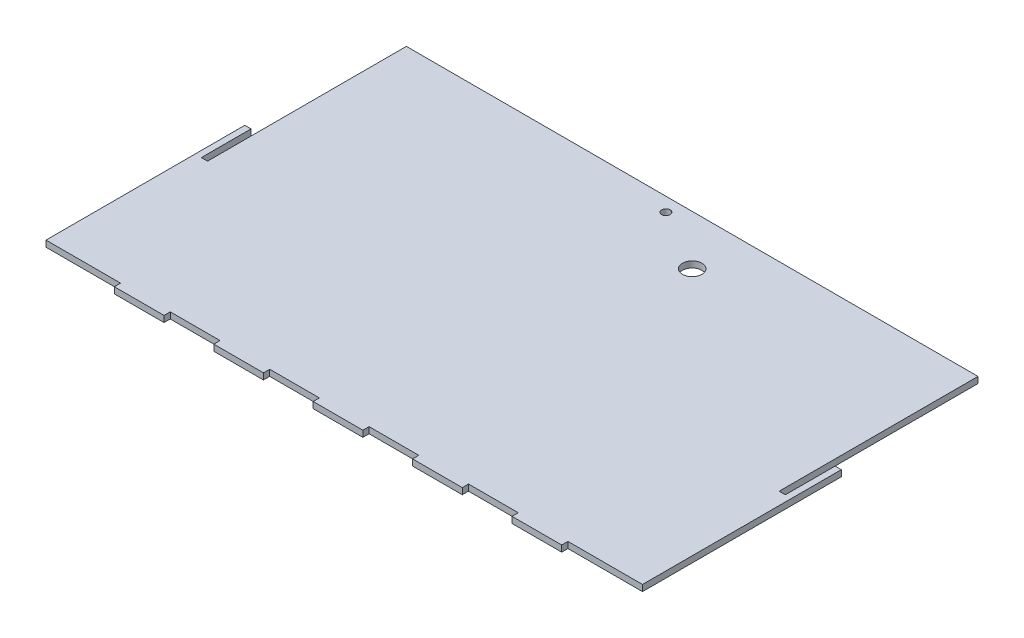
ISO-10303-21;
HEADER;
FILE_DESCRIPTION(('STEP AP214'),'2;1');
FILE_NAME('part.step','',(''),(''),'','','');
FILE_SCHEMA(('AUTOMOTIVE_DESIGN { 1 0 10303 214 1 1 1 1 }'));
ENDSEC;
DATA;
#1=APPLICATION_CONTEXT('core data for automotive mechanical design processes');
#2=APPLICATION_PROTOCOL_DEFINITION('international standard','automotive_design',2000,#1);
#3=PRODUCT_CONTEXT('',#1,'mechanical');
#4=PRODUCT('Part','Part','',(#3));
#5=PRODUCT_RELATED_PRODUCT_CATEGORY('part','',(#4));
#6=PRODUCT_DEFINITION_FORMATION('','',#4);
#7=PRODUCT_DEFINITION_CONTEXT('part definition',#1,'design');
#8=PRODUCT_DEFINITION('design','',#6,#7);
#9=PRODUCT_DEFINITION_SHAPE('','',#8);
#10=(LENGTH_UNIT() NAMED_UNIT(*) SI_UNIT(.MILLI.,.METRE.));
#11=(NAMED_UNIT(*) PLANE_ANGLE_UNIT() SI_UNIT($,.RADIAN.));
#12=(NAMED_UNIT(*) SI_UNIT($,.STERADIAN.) SOLID_ANGLE_UNIT());
#13=UNCERTAINTY_MEASURE_WITH_UNIT(LENGTH_MEASURE(1.E-05),#10,'distance_accuracy_value','');
#14=(GEOMETRIC_REPRESENTATION_CONTEXT(3) GLOBAL_UNCERTAINTY_ASSIGNED_CONTEXT((#13)) GLOBAL_UNIT_ASSIGNED_CONTEXT((#10,
#11,#12)) REPRESENTATION_CONTEXT('',''));
#15=CARTESIAN_POINT('',(0.,0.,0.));
#16=DIRECTION('',(0.,0.,1.));
#17=DIRECTION('',(1.,0.,0.));
#18=AXIS2_PLACEMENT_3D('',#15,#16,#17);
#19=CARTESIAN_POINT('',(-1.52655665885937E-13,1.5875,-12.6999999999982));
#20=DIRECTION('',(0.,0.,-1.));
#21=DIRECTION('',(-1.,0.,0.));
#22=AXIS2_PLACEMENT_3D('',#19,#20,#21);
#23=PLANE('',#22);
#24=DIRECTION('',(1.,0.,0.));
#25=VECTOR('',#24,1.);
#26=CARTESIAN_POINT('',(-1.52655665885937E-13,-1.5875,-12.6999999999982));
#27=LINE('',#26,#25);
#28=CARTESIAN_POINT('',(149.225,-1.5875,-12.7));
#29=VERTEX_POINT('',#28);
#30=CARTESIAN_POINT('',(152.4,-1.5875,-12.7));
#31=VERTEX_POINT('',#30);
#32=EDGE_CURVE('E290',#29,#31,#27,.T.);
#33=ORIENTED_EDGE('',*,*,#32,.F.);
#34=DIRECTION('',(0.,-1.,0.));
#35=VECTOR('',#34,1.);
#36=CARTESIAN_POINT('',(149.225,1.5875,-12.7));
#37=LINE('',#36,#35);
#38=CARTESIAN_POINT('',(149.225,1.5875,-12.7));
#39=VERTEX_POINT('',#38);
#40=EDGE_CURVE('E11',#39,#29,#37,.T.);
#41=ORIENTED_EDGE('',*,*,#40,.F.);
#42=DIRECTION('',(1.,0.,0.));
#43=VECTOR('',#42,1.);
#44=CARTESIAN_POINT('',(-1.52655665885937E-13,1.5875,-12.6999999999982));
#45=LINE('',#44,#43);
#46=CARTESIAN_POINT('',(152.4,1.5875,-12.7));
#47=VERTEX_POINT('',#46);
#48=EDGE_CURVE('E465',#39,#47,#45,.T.);
#49=ORIENTED_EDGE('',*,*,#48,.T.);
#50=DIRECTION('',(0.,-1.,0.));
#51=VECTOR('',#50,1.);
#52=CARTESIAN_POINT('',(152.4,1.5875,-12.7));
#53=LINE('',#52,#51);
#54=EDGE_CURVE('E165',#47,#31,#53,.T.);
#55=ORIENTED_EDGE('',*,*,#54,.T.);
#56=EDGE_LOOP('',(#33,#41,#49,#55));
#57=FACE_BOUND('',#56,.T.);
#58=ADVANCED_FACE('F41',(#57),#23,.T.);
#59=CARTESIAN_POINT('',(149.225,1.5875,0.));
#60=DIRECTION('',(-1.,0.,0.));
#61=DIRECTION('',(0.,0.,1.));
#62=AXIS2_PLACEMENT_3D('',#59,#60,#61);
#63=PLANE('',#62);
#64=DIRECTION('',(0.,0.,-1.));
#65=VECTOR('',#64,1.);
#66=CARTESIAN_POINT('',(149.225,-1.5875,0.));
#67=LINE('',#66,#65);
#68=CARTESIAN_POINT('',(149.225,-1.5875,12.7));
#69=VERTEX_POINT('',#68);
#70=EDGE_CURVE('E292',#69,#29,#67,.T.);
#71=ORIENTED_EDGE('',*,*,#70,.F.);
#72=DIRECTION('',(0.,-1.,0.));
#73=VECTOR('',#72,1.);
#74=CARTESIAN_POINT('',(149.225,1.5875,12.7));
#75=LINE('',#74,#73);
#76=CARTESIAN_POINT('',(149.225,1.5875,12.7));
#77=VERTEX_POINT('',#76);
#78=EDGE_CURVE('E50',#77,#69,#75,.T.);
#79=ORIENTED_EDGE('',*,*,#78,.F.);
#80=DIRECTION('',(0.,0.,-1.));
#81=VECTOR('',#80,1.);
#82=CARTESIAN_POINT('',(149.225,1.5875,0.));
#83=LINE('',#82,#81);
#84=EDGE_CURVE('E461',#77,#39,#83,.T.);
#85=ORIENTED_EDGE('',*,*,#84,.T.);
#86=ORIENTED_EDGE('',*,*,#40,.T.);
#87=EDGE_LOOP('',(#71,#79,#85,#86));
#88=FACE_BOUND('',#87,.T.);
#89=ADVANCED_FACE('F449',(#88),#63,.T.);
#90=CARTESIAN_POINT('',(0.,1.5875,12.7));
#91=DIRECTION('',(0.,0.,-1.));
#92=DIRECTION('',(-1.,0.,0.));
#93=AXIS2_PLACEMENT_3D('',#90,#91,#92);
#94=PLANE('',#93);
#95=DIRECTION('',(1.,0.,0.));
#96=VECTOR('',#95,1.);
#97=CARTESIAN_POINT('',(0.,-1.5875,12.7));
#98=LINE('',#97,#96);
#99=CARTESIAN_POINT('',(146.05,-1.5875,12.7));
#100=VERTEX_POINT('',#99);
#101=EDGE_CURVE('E295',#100,#69,#98,.T.);
#102=ORIENTED_EDGE('',*,*,#101,.F.);
#103=DIRECTION('',(0.,-1.,0.));
#104=VECTOR('',#103,1.);
#105=CARTESIAN_POINT('',(146.05,1.5875,12.7));
#106=LINE('',#105,#104);
#107=CARTESIAN_POINT('',(146.05,1.5875,12.7));
#108=VERTEX_POINT('',#107);
#109=EDGE_CURVE('E438',#108,#100,#106,.T.);
#110=ORIENTED_EDGE('',*,*,#109,.F.);
#111=DIRECTION('',(1.,0.,0.));
#112=VECTOR('',#111,1.);
#113=CARTESIAN_POINT('',(0.,1.5875,12.7));
#114=LINE('',#113,#112);
#115=EDGE_CURVE('E445',#108,#77,#114,.T.);
#116=ORIENTED_EDGE('',*,*,#115,.T.);
#117=ORIENTED_EDGE('',*,*,#78,.T.);
#118=EDGE_LOOP('',(#102,#110,#116,#117));
#119=FACE_BOUND('',#118,.T.);
#120=ADVANCED_FACE('F443',(#119),#94,.T.);
#121=CARTESIAN_POINT('',(146.05,1.5875,0.));
#122=DIRECTION('',(1.,0.,0.));
#123=DIRECTION('',(0.,0.,-1.));
#124=AXIS2_PLACEMENT_3D('',#121,#122,#123);
#125=PLANE('',#124);
#126=DIRECTION('',(0.,0.,1.));
#127=VECTOR('',#126,1.);
#128=CARTESIAN_POINT('',(146.05,-1.5875,0.));
#129=LINE('',#128,#127);
#130=CARTESIAN_POINT('',(146.05,-1.5875,-88.9));
#131=VERTEX_POINT('',#130);
#132=EDGE_CURVE('E298',#131,#100,#129,.T.);
#133=ORIENTED_EDGE('',*,*,#132,.F.);
#134=DIRECTION('',(0.,-1.,0.));
#135=VECTOR('',#134,1.);
#136=CARTESIAN_POINT('',(146.05,1.5875,-88.9));
#137=LINE('',#136,#135);
#138=CARTESIAN_POINT('',(146.05,1.5875,-88.9));
#139=VERTEX_POINT('',#138);
#140=EDGE_CURVE('E436',#139,#131,#137,.T.);
#141=ORIENTED_EDGE('',*,*,#140,.F.);
#142=DIRECTION('',(0.,0.,1.));
#143=VECTOR('',#142,1.);
#144=CARTESIAN_POINT('',(146.05,1.5875,0.));
#145=LINE('',#144,#143);
#146=EDGE_CURVE('E458',#139,#108,#145,.T.);
#147=ORIENTED_EDGE('',*,*,#146,.T.);
#148=ORIENTED_EDGE('',*,*,#109,.T.);
#149=EDGE_LOOP('',(#133,#141,#147,#148));
#150=FACE_BOUND('',#149,.T.);
#151=ADVANCED_FACE('F455',(#150),#125,.T.);
#152=CARTESIAN_POINT('',(0.,1.5875,-88.9));
#153=DIRECTION('',(0.,0.,-1.));
#154=DIRECTION('',(-1.,0.,0.));
#155=AXIS2_PLACEMENT_3D('',#152,#153,#154);
#156=PLANE('',#155);
#157=DIRECTION('',(1.,0.,0.));
#158=VECTOR('',#157,1.);
#159=CARTESIAN_POINT('',(0.,-1.5875,-88.9));
#160=LINE('',#159,#158);
#161=CARTESIAN_POINT('',(-146.05,-1.5875,-88.9));
#162=VERTEX_POINT('',#161);
#163=EDGE_CURVE('E301',#162,#131,#160,.T.);
#164=ORIENTED_EDGE('',*,*,#163,.F.);
#165=DIRECTION('',(0.,-1.,0.));
#166=VECTOR('',#165,1.);
#167=CARTESIAN_POINT('',(-146.05,1.5875,-88.9));
#168=LINE('',#167,#166);
#169=CARTESIAN_POINT('',(-146.05,1.5875,-88.9));
#170=VERTEX_POINT('',#169);
#171=EDGE_CURVE('E434',#170,#162,#168,.T.);
#172=ORIENTED_EDGE('',*,*,#171,.F.);
#173=DIRECTION('',(1.,0.,0.));
#174=VECTOR('',#173,1.);
#175=CARTESIAN_POINT('',(0.,1.5875,-88.9));
#176=LINE('',#175,#174);
#177=EDGE_CURVE('E463',#170,#139,#176,.T.);
#178=ORIENTED_EDGE('',*,*,#177,.T.);
#179=ORIENTED_EDGE('',*,*,#140,.T.);
#180=EDGE_LOOP('',(#164,#172,#178,#179));
#181=FACE_BOUND('',#180,.T.);
#182=ADVANCED_FACE('F613',(#181),#156,.T.);
#183=CARTESIAN_POINT('',(-146.05,1.5875,0.));
#184=DIRECTION('',(1.,0.,0.));
#185=DIRECTION('',(0.,0.,-1.));
#186=AXIS2_PLACEMENT_3D('',#183,#184,#185);
#187=PLANE('',#186);
#188=DIRECTION('',(0.,0.,1.));
#189=VECTOR('',#188,1.);
#190=CARTESIAN_POINT('',(-146.05,-1.5875,0.));
#191=LINE('',#190,#189);
#192=CARTESIAN_POINT('',(-146.05,-1.5875,12.7));
#193=VERTEX_POINT('',#192);
#194=EDGE_CURVE('E304',#162,#193,#191,.T.);
#195=ORIENTED_EDGE('',*,*,#194,.T.);
#196=DIRECTION('',(0.,-1.,0.));
#197=VECTOR('',#196,1.);
#198=CARTESIAN_POINT('',(-146.05,1.5875,12.7));
#199=LINE('',#198,#197);
#200=CARTESIAN_POINT('',(-146.05,1.5875,12.7));
#201=VERTEX_POINT('',#200);
#202=EDGE_CURVE('E431',#201,#193,#199,.T.);
#203=ORIENTED_EDGE('',*,*,#202,.F.);
#204=DIRECTION('',(0.,0.,1.));
#205=VECTOR('',#204,1.);
#206=CARTESIAN_POINT('',(-146.05,1.5875,0.));
#207=LINE('',#206,#205);
#208=EDGE_CURVE('E470',#170,#201,#207,.T.);
#209=ORIENTED_EDGE('',*,*,#208,.F.);
#210=ORIENTED_EDGE('',*,*,#171,.T.);
#211=EDGE_LOOP('',(#195,#203,#209,#210));
#212=FACE_BOUND('',#211,.T.);
#213=ADVANCED_FACE('F615',(#212),#187,.F.);
#214=CARTESIAN_POINT('',(0.,1.5875,12.7));
#215=DIRECTION('',(0.,0.,1.));
#216=DIRECTION('',(1.,0.,0.));
#217=AXIS2_PLACEMENT_3D('',#214,#215,#216);
#218=PLANE('',#217);
#219=DIRECTION('',(-1.,0.,0.));
#220=VECTOR('',#219,1.);
#221=CARTESIAN_POINT('',(0.,-1.5875,12.7));
#222=LINE('',#221,#220);
#223=CARTESIAN_POINT('',(-149.225,-1.5875,12.7));
#224=VERTEX_POINT('',#223);
#225=EDGE_CURVE('E307',#193,#224,#222,.T.);
#226=ORIENTED_EDGE('',*,*,#225,.T.);
#227=DIRECTION('',(0.,-1.,0.));
#228=VECTOR('',#227,1.);
#229=CARTESIAN_POINT('',(-149.225,1.5875,12.7));
#230=LINE('',#229,#228);
#231=CARTESIAN_POINT('',(-149.225,1.5875,12.7));
#232=VERTEX_POINT('',#231);
#233=EDGE_CURVE('E428',#232,#224,#230,.T.);
#234=ORIENTED_EDGE('',*,*,#233,.F.);
#235=DIRECTION('',(-1.,0.,0.));
#236=VECTOR('',#235,1.);
#237=CARTESIAN_POINT('',(0.,1.5875,12.7));
#238=LINE('',#237,#236);
#239=EDGE_CURVE('E473',#201,#232,#238,.T.);
#240=ORIENTED_EDGE('',*,*,#239,.F.);
#241=ORIENTED_EDGE('',*,*,#202,.T.);
#242=EDGE_LOOP('',(#226,#234,#240,#241));
#243=FACE_BOUND('',#242,.T.);
#244=ADVANCED_FACE('F609',(#243),#218,.F.);
#245=CARTESIAN_POINT('',(-149.225,1.5875,0.));
#246=DIRECTION('',(-1.,0.,0.));
#247=DIRECTION('',(0.,0.,1.));
#248=AXIS2_PLACEMENT_3D('',#245,#246,#247);
#249=PLANE('',#248);
#250=DIRECTION('',(0.,0.,-1.));
#251=VECTOR('',#250,1.);
#252=CARTESIAN_POINT('',(-149.225,-1.5875,0.));
#253=LINE('',#252,#251);
#254=CARTESIAN_POINT('',(-149.225,-1.5875,-12.7));
#255=VERTEX_POINT('',#254);
#256=EDGE_CURVE('E310',#224,#255,#253,.T.);
#257=ORIENTED_EDGE('',*,*,#256,.T.);
#258=DIRECTION('',(0.,-1.,0.));
#259=VECTOR('',#258,1.);
#260=CARTESIAN_POINT('',(-149.225,1.5875,-12.7));
#261=LINE('',#260,#259);
#262=CARTESIAN_POINT('',(-149.225,1.5875,-12.7));
#263=VERTEX_POINT('',#262);
#264=EDGE_CURVE('E425',#263,#255,#261,.T.);
#265=ORIENTED_EDGE('',*,*,#264,.F.);
#266=DIRECTION('',(0.,0.,-1.));
#267=VECTOR('',#266,1.);
#268=CARTESIAN_POINT('',(-149.225,1.5875,0.));
#269=LINE('',#268,#267);
#270=EDGE_CURVE('E476',#232,#263,#269,.T.);
#271=ORIENTED_EDGE('',*,*,#270,.F.);
#272=ORIENTED_EDGE('',*,*,#233,.T.);
#273=EDGE_LOOP('',(#257,#265,#271,#272));
#274=FACE_BOUND('',#273,.T.);
#275=ADVANCED_FACE('F606',(#274),#249,.F.);
#276=CARTESIAN_POINT('',(0.,1.5875,-12.7000000000003));
#277=DIRECTION('',(0.,0.,1.));
#278=DIRECTION('',(1.,0.,0.));
#279=AXIS2_PLACEMENT_3D('',#276,#277,#278);
#280=PLANE('',#279);
#281=DIRECTION('',(-1.,0.,0.));
#282=VECTOR('',#281,1.);
#283=CARTESIAN_POINT('',(0.,-1.5875,-12.7000000000003));
#284=LINE('',#283,#282);
#285=CARTESIAN_POINT('',(-152.4,-1.5875,-12.7));
#286=VERTEX_POINT('',#285);
#287=EDGE_CURVE('E313',#255,#286,#284,.T.);
#288=ORIENTED_EDGE('',*,*,#287,.T.);
#289=DIRECTION('',(0.,-1.,0.));
#290=VECTOR('',#289,1.);
#291=CARTESIAN_POINT('',(-152.4,1.5875,-12.7));
#292=LINE('',#291,#290);
#293=CARTESIAN_POINT('',(-152.4,1.5875,-12.7));
#294=VERTEX_POINT('',#293);
#295=EDGE_CURVE('E423',#294,#286,#292,.T.);
#296=ORIENTED_EDGE('',*,*,#295,.F.);
#297=DIRECTION('',(-1.,0.,0.));
#298=VECTOR('',#297,1.);
#299=CARTESIAN_POINT('',(0.,1.5875,-12.7000000000003));
#300=LINE('',#299,#298);
#301=EDGE_CURVE('E479',#263,#294,#300,.T.);
#302=ORIENTED_EDGE('',*,*,#301,.F.);
#303=ORIENTED_EDGE('',*,*,#264,.T.);
#304=EDGE_LOOP('',(#288,#296,#302,#303));
#305=FACE_BOUND('',#304,.T.);
#306=ADVANCED_FACE('F604',(#305),#280,.F.);
#307=CARTESIAN_POINT('',(-152.4,1.5875,0.));
#308=DIRECTION('',(-1.,0.,0.));
#309=DIRECTION('',(0.,0.,1.));
#310=AXIS2_PLACEMENT_3D('',#307,#308,#309);
#311=PLANE('',#310);
#312=DIRECTION('',(0.,0.,-1.));
#313=VECTOR('',#312,1.);
#314=CARTESIAN_POINT('',(-152.4,-1.5875,0.));
#315=LINE('',#314,#313);
#316=CARTESIAN_POINT('',(-152.4,-1.5875,88.9));
#317=VERTEX_POINT('',#316);
#318=EDGE_CURVE('E316',#317,#286,#315,.T.);
#319=ORIENTED_EDGE('',*,*,#318,.F.);
#320=DIRECTION('',(0.,-1.,0.));
#321=VECTOR('',#320,1.);
#322=CARTESIAN_POINT('',(-152.4,1.5875,88.9));
#323=LINE('',#322,#321);
#324=CARTESIAN_POINT('',(-152.4,1.5875,88.9));
#325=VERTEX_POINT('',#324);
#326=EDGE_CURVE('E421',#325,#317,#323,.T.);
#327=ORIENTED_EDGE('',*,*,#326,.F.);
#328=DIRECTION('',(0.,0.,-1.));
#329=VECTOR('',#328,1.);
#330=CARTESIAN_POINT('',(-152.4,1.5875,0.));
#331=LINE('',#330,#329);
#332=EDGE_CURVE('E481',#325,#294,#331,.T.);
#333=ORIENTED_EDGE('',*,*,#332,.T.);
#334=ORIENTED_EDGE('',*,*,#295,.T.);
#335=EDGE_LOOP('',(#319,#327,#333,#334));
#336=FACE_BOUND('',#335,.T.);
#337=ADVANCED_FACE('F600',(#336),#311,.T.);
#338=CARTESIAN_POINT('',(0.,1.5875,88.9));
#339=DIRECTION('',(0.,0.,-1.));
#340=DIRECTION('',(-1.,0.,0.));
#341=AXIS2_PLACEMENT_3D('',#338,#339,#340);
#342=PLANE('',#341);
#343=DIRECTION('',(1.,0.,0.));
#344=VECTOR('',#343,1.);
#345=CARTESIAN_POINT('',(0.,-1.5875,88.9));
#346=LINE('',#345,#344);
#347=CARTESIAN_POINT('',(-114.3,-1.5875,88.9));
#348=VERTEX_POINT('',#347);
#349=EDGE_CURVE('E319',#317,#348,#346,.T.);
#350=ORIENTED_EDGE('',*,*,#349,.T.);
#351=DIRECTION('',(0.,-1.,0.));
#352=VECTOR('',#351,1.);
#353=CARTESIAN_POINT('',(-114.3,1.5875,88.9));
#354=LINE('',#353,#352);
#355=CARTESIAN_POINT('',(-114.3,1.5875,88.9));
#356=VERTEX_POINT('',#355);
#357=EDGE_CURVE('E418',#356,#348,#354,.T.);
#358=ORIENTED_EDGE('',*,*,#357,.F.);
#359=DIRECTION('',(1.,0.,0.));
#360=VECTOR('',#359,1.);
#361=CARTESIAN_POINT('',(0.,1.5875,88.9));
#362=LINE('',#361,#360);
#363=EDGE_CURVE('E273',#325,#356,#362,.T.);
#364=ORIENTED_EDGE('',*,*,#363,.F.);
#365=ORIENTED_EDGE('',*,*,#326,.T.);
#366=EDGE_LOOP('',(#350,#358,#364,#365));
#367=FACE_BOUND('',#366,.T.);
#368=ADVANCED_FACE('F597',(#367),#342,.F.);
#369=CARTESIAN_POINT('',(-114.3,1.5875,0.));
#370=DIRECTION('',(1.,0.,0.));
#371=DIRECTION('',(0.,0.,-1.));
#372=AXIS2_PLACEMENT_3D('',#369,#370,#371);
#373=PLANE('',#372);
#374=DIRECTION('',(0.,0.,1.));
#375=VECTOR('',#374,1.);
#376=CARTESIAN_POINT('',(-114.3,-1.5875,0.));
#377=LINE('',#376,#375);
#378=CARTESIAN_POINT('',(-114.3,-1.5875,92.075));
#379=VERTEX_POINT('',#378);
#380=EDGE_CURVE('E322',#348,#379,#377,.T.);
#381=ORIENTED_EDGE('',*,*,#380,.T.);
#382=DIRECTION('',(0.,-1.,0.));
#383=VECTOR('',#382,1.);
#384=CARTESIAN_POINT('',(-114.3,1.5875,92.075));
#385=LINE('',#384,#383);
#386=CARTESIAN_POINT('',(-114.3,1.5875,92.075));
#387=VERTEX_POINT('',#386);
#388=EDGE_CURVE('E415',#387,#379,#385,.T.);
#389=ORIENTED_EDGE('',*,*,#388,.F.);
#390=DIRECTION('',(0.,0.,1.));
#391=VECTOR('',#390,1.);
#392=CARTESIAN_POINT('',(-114.3,1.5875,0.));
#393=LINE('',#392,#391);
#394=EDGE_CURVE('E485',#356,#387,#393,.T.);
#395=ORIENTED_EDGE('',*,*,#394,.F.);
#396=ORIENTED_EDGE('',*,*,#357,.T.);
#397=EDGE_LOOP('',(#381,#389,#395,#396));
#398=FACE_BOUND('',#397,.T.);
#399=ADVANCED_FACE('F594',(#398),#373,.F.);
#400=CARTESIAN_POINT('',(0.,1.5875,92.075));
#401=DIRECTION('',(0.,0.,-1.));
#402=DIRECTION('',(-1.,0.,0.));
#403=AXIS2_PLACEMENT_3D('',#400,#401,#402);
#404=PLANE('',#403);
#405=DIRECTION('',(1.,0.,0.));
#406=VECTOR('',#405,1.);
#407=CARTESIAN_POINT('',(0.,-1.5875,92.075));
#408=LINE('',#407,#406);
#409=CARTESIAN_POINT('',(-88.9,-1.5875,92.075));
#410=VERTEX_POINT('',#409);
#411=EDGE_CURVE('E327',#379,#410,#408,.T.);
#412=ORIENTED_EDGE('',*,*,#411,.T.);
#413=DIRECTION('',(0.,-1.,0.));
#414=VECTOR('',#413,1.);
#415=CARTESIAN_POINT('',(-88.9,1.5875,92.075));
#416=LINE('',#415,#414);
#417=CARTESIAN_POINT('',(-88.9,1.5875,92.075));
#418=VERTEX_POINT('',#417);
#419=EDGE_CURVE('E413',#418,#410,#416,.T.);
#420=ORIENTED_EDGE('',*,*,#419,.F.);
#421=DIRECTION('',(1.,0.,0.));
#422=VECTOR('',#421,1.);
#423=CARTESIAN_POINT('',(0.,1.5875,92.075));
#424=LINE('',#423,#422);
#425=EDGE_CURVE('E489',#387,#418,#424,.T.);
#426=ORIENTED_EDGE('',*,*,#425,.F.);
#427=ORIENTED_EDGE('',*,*,#388,.T.);
#428=EDGE_LOOP('',(#412,#420,#426,#427));
#429=FACE_BOUND('',#428,.T.);
#430=ADVANCED_FACE('F588',(#429),#404,.F.);
#431=CARTESIAN_POINT('',(-88.9,1.5875,0.));
#432=DIRECTION('',(1.,0.,0.));
#433=DIRECTION('',(0.,0.,-1.));
#434=AXIS2_PLACEMENT_3D('',#431,#432,#433);
#435=PLANE('',#434);
#436=DIRECTION('',(0.,0.,1.));
#437=VECTOR('',#436,1.);
#438=CARTESIAN_POINT('',(-88.9,-1.5875,0.));
#439=LINE('',#438,#437);
#440=CARTESIAN_POINT('',(-88.9,-1.5875,88.9));
#441=VERTEX_POINT('',#440);
#442=EDGE_CURVE('E330',#441,#410,#439,.T.);
#443=ORIENTED_EDGE('',*,*,#442,.F.);
#444=DIRECTION('',(0.,-1.,0.));
#445=VECTOR('',#444,1.);
#446=CARTESIAN_POINT('',(-88.9,1.5875,88.9));
#447=LINE('',#446,#445);
#448=CARTESIAN_POINT('',(-88.9,1.5875,88.9));
#449=VERTEX_POINT('',#448);
#450=EDGE_CURVE('E411',#449,#441,#447,.T.);
#451=ORIENTED_EDGE('',*,*,#450,.F.);
#452=DIRECTION('',(0.,0.,1.));
#453=VECTOR('',#452,1.);
#454=CARTESIAN_POINT('',(-88.9,1.5875,0.));
#455=LINE('',#454,#453);
#456=EDGE_CURVE('E491',#449,#418,#455,.T.);
#457=ORIENTED_EDGE('',*,*,#456,.T.);
#458=ORIENTED_EDGE('',*,*,#419,.T.);
#459=EDGE_LOOP('',(#443,#451,#457,#458));
#460=FACE_BOUND('',#459,.T.);
#461=ADVANCED_FACE('F585',(#460),#435,.T.);
#462=CARTESIAN_POINT('',(-63.5,-1.5875,88.9));
#463=VERTEX_POINT('',#462);
#464=EDGE_CURVE('E324',#441,#463,#346,.T.);
#465=ORIENTED_EDGE('',*,*,#464,.T.);
#466=DIRECTION('',(0.,-1.,0.));
#467=VECTOR('',#466,1.);
#468=CARTESIAN_POINT('',(-63.5,1.5875,88.9));
#469=LINE('',#468,#467);
#470=CARTESIAN_POINT('',(-63.5,1.5875,88.9));
#471=VERTEX_POINT('',#470);
#472=EDGE_CURVE('E408',#471,#463,#469,.T.);
#473=ORIENTED_EDGE('',*,*,#472,.F.);
#474=EDGE_CURVE('E486',#449,#471,#362,.T.);
#475=ORIENTED_EDGE('',*,*,#474,.F.);
#476=ORIENTED_EDGE('',*,*,#450,.T.);
#477=EDGE_LOOP('',(#465,#473,#475,#476));
#478=FACE_BOUND('',#477,.T.);
#479=ADVANCED_FACE('F539',(#478),#342,.F.);
#480=CARTESIAN_POINT('',(-63.5,1.5875,0.));
#481=DIRECTION('',(1.,0.,0.));
#482=DIRECTION('',(0.,0.,-1.));
#483=AXIS2_PLACEMENT_3D('',#480,#481,#482);
#484=PLANE('',#483);
#485=DIRECTION('',(0.,0.,1.));
#486=VECTOR('',#485,1.);
#487=CARTESIAN_POINT('',(-63.5,-1.5875,0.));
#488=LINE('',#487,#486);
#489=CARTESIAN_POINT('',(-63.5,-1.5875,92.075));
#490=VERTEX_POINT('',#489);
#491=EDGE_CURVE('E333',#463,#490,#488,.T.);
#492=ORIENTED_EDGE('',*,*,#491,.T.);
#493=DIRECTION('',(0.,-1.,0.));
#494=VECTOR('',#493,1.);
#495=CARTESIAN_POINT('',(-63.5,1.5875,92.075));
#496=LINE('',#495,#494);
#497=CARTESIAN_POINT('',(-63.5,1.5875,92.075));
#498=VERTEX_POINT('',#497);
#499=EDGE_CURVE('E405',#498,#490,#496,.T.);
#500=ORIENTED_EDGE('',*,*,#499,.F.);
#501=DIRECTION('',(0.,0.,1.));
#502=VECTOR('',#501,1.);
#503=CARTESIAN_POINT('',(-63.5,1.5875,0.));
#504=LINE('',#503,#502);
#505=EDGE_CURVE('E494',#471,#498,#504,.T.);
#506=ORIENTED_EDGE('',*,*,#505,.F.);
#507=ORIENTED_EDGE('',*,*,#472,.T.);
#508=EDGE_LOOP('',(#492,#500,#506,#507));
#509=FACE_BOUND('',#508,.T.);
#510=ADVANCED_FACE('F542',(#509),#484,.F.);
#511=CARTESIAN_POINT('',(0.,1.5875,92.075));
#512=DIRECTION('',(0.,0.,-1.));
#513=DIRECTION('',(-1.,0.,0.));
#514=AXIS2_PLACEMENT_3D('',#511,#512,#513);
#515=PLANE('',#514);
#516=DIRECTION('',(1.,0.,0.));
#517=VECTOR('',#516,1.);
#518=CARTESIAN_POINT('',(0.,-1.5875,92.075));
#519=LINE('',#518,#517);
#520=CARTESIAN_POINT('',(-38.1,-1.5875,92.075));
#521=VERTEX_POINT('',#520);
#522=EDGE_CURVE('E336',#490,#521,#519,.T.);
#523=ORIENTED_EDGE('',*,*,#522,.T.);
#524=DIRECTION('',(0.,-1.,0.));
#525=VECTOR('',#524,1.);
#526=CARTESIAN_POINT('',(-38.1,1.5875,92.075));
#527=LINE('',#526,#525);
#528=CARTESIAN_POINT('',(-38.1,1.5875,92.075));
#529=VERTEX_POINT('',#528);
#530=EDGE_CURVE('E403',#529,#521,#527,.T.);
#531=ORIENTED_EDGE('',*,*,#530,.F.);
#532=DIRECTION('',(1.,0.,0.));
#533=VECTOR('',#532,1.);
#534=CARTESIAN_POINT('',(0.,1.5875,92.075));
#535=LINE('',#534,#533);
#536=EDGE_CURVE('E497',#498,#529,#535,.T.);
#537=ORIENTED_EDGE('',*,*,#536,.F.);
#538=ORIENTED_EDGE('',*,*,#499,.T.);
#539=EDGE_LOOP('',(#523,#531,#537,#538));
#540=FACE_BOUND('',#539,.T.);
#541=ADVANCED_FACE('F544',(#540),#515,.F.);
#542=CARTESIAN_POINT('',(-38.1,1.5875,0.));
#543=DIRECTION('',(1.,0.,0.));
#544=DIRECTION('',(0.,0.,-1.));
#545=AXIS2_PLACEMENT_3D('',#542,#543,#544);
#546=PLANE('',#545);
#547=DIRECTION('',(0.,0.,1.));
#548=VECTOR('',#547,1.);
#549=CARTESIAN_POINT('',(-38.1,-1.5875,0.));
#550=LINE('',#549,#548);
#551=CARTESIAN_POINT('',(-38.1,-1.5875,88.9));
#552=VERTEX_POINT('',#551);
#553=EDGE_CURVE('E339',#552,#521,#550,.T.);
#554=ORIENTED_EDGE('',*,*,#553,.F.);
#555=DIRECTION('',(0.,-1.,0.));
#556=VECTOR('',#555,1.);
#557=CARTESIAN_POINT('',(-38.1,1.5875,88.9));
#558=LINE('',#557,#556);
#559=CARTESIAN_POINT('',(-38.1,1.5875,88.9));
#560=VERTEX_POINT('',#559);
#561=EDGE_CURVE('E401',#560,#552,#558,.T.);
#562=ORIENTED_EDGE('',*,*,#561,.F.);
#563=DIRECTION('',(0.,0.,1.));
#564=VECTOR('',#563,1.);
#565=CARTESIAN_POINT('',(-38.1,1.5875,0.));
#566=LINE('',#565,#564);
#567=EDGE_CURVE('E499',#560,#529,#566,.T.);
#568=ORIENTED_EDGE('',*,*,#567,.T.);
#569=ORIENTED_EDGE('',*,*,#530,.T.);
#570=EDGE_LOOP('',(#554,#562,#568,#569));
#571=FACE_BOUND('',#570,.T.);
#572=ADVANCED_FACE('F548',(#571),#546,.T.);
#573=CARTESIAN_POINT('',(-12.7,-1.5875,88.9));
#574=VERTEX_POINT('',#573);
#575=EDGE_CURVE('E342',#552,#574,#346,.T.);
#576=ORIENTED_EDGE('',*,*,#575,.T.);
#577=DIRECTION('',(0.,-1.,0.));
#578=VECTOR('',#577,1.);
#579=CARTESIAN_POINT('',(-12.7,1.5875,88.9));
#580=LINE('',#579,#578);
#581=CARTESIAN_POINT('',(-12.7,1.5875,88.9));
#582=VERTEX_POINT('',#581);
#583=EDGE_CURVE('E398',#582,#574,#580,.T.);
#584=ORIENTED_EDGE('',*,*,#583,.F.);
#585=EDGE_CURVE('E502',#560,#582,#362,.T.);
#586=ORIENTED_EDGE('',*,*,#585,.F.);
#587=ORIENTED_EDGE('',*,*,#561,.T.);
#588=EDGE_LOOP('',(#576,#584,#586,#587));
#589=FACE_BOUND('',#588,.T.);
#590=ADVANCED_FACE('F552',(#589),#342,.F.);
#591=CARTESIAN_POINT('',(-12.7,1.5875,0.));
#592=DIRECTION('',(1.,0.,0.));
#593=DIRECTION('',(0.,0.,-1.));
#594=AXIS2_PLACEMENT_3D('',#591,#592,#593);
#595=PLANE('',#594);
#596=DIRECTION('',(0.,0.,1.));
#597=VECTOR('',#596,1.);
#598=CARTESIAN_POINT('',(-12.7,-1.5875,0.));
#599=LINE('',#598,#597);
#600=CARTESIAN_POINT('',(-12.7,-1.5875,92.075));
#601=VERTEX_POINT('',#600);
#602=EDGE_CURVE('E343',#574,#601,#599,.T.);
#603=ORIENTED_EDGE('',*,*,#602,.T.);
#604=DIRECTION('',(0.,-1.,0.));
#605=VECTOR('',#604,1.);
#606=CARTESIAN_POINT('',(-12.7,1.5875,92.075));
#607=LINE('',#606,#605);
#608=CARTESIAN_POINT('',(-12.7,1.5875,92.075));
#609=VERTEX_POINT('',#608);
#610=EDGE_CURVE('E395',#609,#601,#607,.T.);
#611=ORIENTED_EDGE('',*,*,#610,.F.);
#612=DIRECTION('',(0.,0.,1.));
#613=VECTOR('',#612,1.);
#614=CARTESIAN_POINT('',(-12.7,1.5875,0.));
#615=LINE('',#614,#613);
#616=EDGE_CURVE('E503',#582,#609,#615,.T.);
#617=ORIENTED_EDGE('',*,*,#616,.F.);
#618=ORIENTED_EDGE('',*,*,#583,.T.);
#619=EDGE_LOOP('',(#603,#611,#617,#618));
#620=FACE_BOUND('',#619,.T.);
#621=ADVANCED_FACE('F554',(#620),#595,.F.);
#622=CARTESIAN_POINT('',(0.,1.5875,92.075));
#623=DIRECTION('',(0.,0.,-1.));
#624=DIRECTION('',(-1.,0.,0.));
#625=AXIS2_PLACEMENT_3D('',#622,#623,#624);
#626=PLANE('',#625);
#627=DIRECTION('',(1.,0.,0.));
#628=VECTOR('',#627,1.);
#629=CARTESIAN_POINT('',(0.,-1.5875,92.075));
#630=LINE('',#629,#628);
#631=CARTESIAN_POINT('',(12.7,-1.5875,92.075));
#632=VERTEX_POINT('',#631);
#633=EDGE_CURVE('E346',#601,#632,#630,.T.);
#634=ORIENTED_EDGE('',*,*,#633,.T.);
#635=DIRECTION('',(0.,-1.,0.));
#636=VECTOR('',#635,1.);
#637=CARTESIAN_POINT('',(12.7,1.5875,92.075));
#638=LINE('',#637,#636);
#639=CARTESIAN_POINT('',(12.7,1.5875,92.075));
#640=VERTEX_POINT('',#639);
#641=EDGE_CURVE('E393',#640,#632,#638,.T.);
#642=ORIENTED_EDGE('',*,*,#641,.F.);
#643=DIRECTION('',(1.,0.,0.));
#644=VECTOR('',#643,1.);
#645=CARTESIAN_POINT('',(0.,1.5875,92.075));
#646=LINE('',#645,#644);
#647=EDGE_CURVE('E506',#609,#640,#646,.T.);
#648=ORIENTED_EDGE('',*,*,#647,.F.);
#649=ORIENTED_EDGE('',*,*,#610,.T.);
#650=EDGE_LOOP('',(#634,#642,#648,#649));
#651=FACE_BOUND('',#650,.T.);
#652=ADVANCED_FACE('F558',(#651),#626,.F.);
#653=CARTESIAN_POINT('',(12.7,1.5875,0.));
#654=DIRECTION('',(1.,0.,0.));
#655=DIRECTION('',(0.,0.,-1.));
#656=AXIS2_PLACEMENT_3D('',#653,#654,#655);
#657=PLANE('',#656);
#658=DIRECTION('',(0.,0.,1.));
#659=VECTOR('',#658,1.);
#660=CARTESIAN_POINT('',(12.7,-1.5875,0.));
#661=LINE('',#660,#659);
#662=CARTESIAN_POINT('',(12.7,-1.5875,88.9));
#663=VERTEX_POINT('',#662);
#664=EDGE_CURVE('E349',#663,#632,#661,.T.);
#665=ORIENTED_EDGE('',*,*,#664,.F.);
#666=DIRECTION('',(0.,-1.,0.));
#667=VECTOR('',#666,1.);
#668=CARTESIAN_POINT('',(12.7,1.5875,88.9));
#669=LINE('',#668,#667);
#670=CARTESIAN_POINT('',(12.7,1.5875,88.9));
#671=VERTEX_POINT('',#670);
#672=EDGE_CURVE('E391',#671,#663,#669,.T.);
#673=ORIENTED_EDGE('',*,*,#672,.F.);
#674=DIRECTION('',(0.,0.,1.));
#675=VECTOR('',#674,1.);
#676=CARTESIAN_POINT('',(12.7,1.5875,0.));
#677=LINE('',#676,#675);
#678=EDGE_CURVE('E508',#671,#640,#677,.T.);
#679=ORIENTED_EDGE('',*,*,#678,.T.);
#680=ORIENTED_EDGE('',*,*,#641,.T.);
#681=EDGE_LOOP('',(#665,#673,#679,#680));
#682=FACE_BOUND('',#681,.T.);
#683=ADVANCED_FACE('F561',(#682),#657,.T.);
#684=CARTESIAN_POINT('',(38.1,-1.5875,88.9));
#685=VERTEX_POINT('',#684);
#686=EDGE_CURVE('E352',#663,#685,#346,.T.);
#687=ORIENTED_EDGE('',*,*,#686,.T.);
#688=DIRECTION('',(0.,-1.,0.));
#689=VECTOR('',#688,1.);
#690=CARTESIAN_POINT('',(38.1,1.5875,88.9));
#691=LINE('',#690,#689);
#692=CARTESIAN_POINT('',(38.1,1.5875,88.9));
#693=VERTEX_POINT('',#692);
#694=EDGE_CURVE('E388',#693,#685,#691,.T.);
#695=ORIENTED_EDGE('',*,*,#694,.F.);
#696=EDGE_CURVE('E511',#671,#693,#362,.T.);
#697=ORIENTED_EDGE('',*,*,#696,.F.);
#698=ORIENTED_EDGE('',*,*,#672,.T.);
#699=EDGE_LOOP('',(#687,#695,#697,#698));
#700=FACE_BOUND('',#699,.T.);
#701=ADVANCED_FACE('F565',(#700),#342,.F.);
#702=CARTESIAN_POINT('',(38.1,1.5875,0.));
#703=DIRECTION('',(1.,0.,0.));
#704=DIRECTION('',(0.,0.,-1.));
#705=AXIS2_PLACEMENT_3D('',#702,#703,#704);
#706=PLANE('',#705);
#707=DIRECTION('',(0.,0.,1.));
#708=VECTOR('',#707,1.);
#709=CARTESIAN_POINT('',(38.1,-1.5875,0.));
#710=LINE('',#709,#708);
#711=CARTESIAN_POINT('',(38.1,-1.5875,92.075));
#712=VERTEX_POINT('',#711);
#713=EDGE_CURVE('E353',#685,#712,#710,.T.);
#714=ORIENTED_EDGE('',*,*,#713,.T.);
#715=DIRECTION('',(0.,-1.,0.));
#716=VECTOR('',#715,1.);
#717=CARTESIAN_POINT('',(38.1,1.5875,92.075));
#718=LINE('',#717,#716);
#719=CARTESIAN_POINT('',(38.1,1.5875,92.075));
#720=VERTEX_POINT('',#719);
#721=EDGE_CURVE('E385',#720,#712,#718,.T.);
#722=ORIENTED_EDGE('',*,*,#721,.F.);
#723=DIRECTION('',(0.,0.,1.));
#724=VECTOR('',#723,1.);
#725=CARTESIAN_POINT('',(38.1,1.5875,0.));
#726=LINE('',#725,#724);
#727=EDGE_CURVE('E512',#693,#720,#726,.T.);
#728=ORIENTED_EDGE('',*,*,#727,.F.);
#729=ORIENTED_EDGE('',*,*,#694,.T.);
#730=EDGE_LOOP('',(#714,#722,#728,#729));
#731=FACE_BOUND('',#730,.T.);
#732=ADVANCED_FACE('F567',(#731),#706,.F.);
#733=CARTESIAN_POINT('',(0.,1.5875,92.075));
#734=DIRECTION('',(0.,0.,-1.));
#735=DIRECTION('',(-1.,0.,0.));
#736=AXIS2_PLACEMENT_3D('',#733,#734,#735);
#737=PLANE('',#736);
#738=DIRECTION('',(1.,0.,0.));
#739=VECTOR('',#738,1.);
#740=CARTESIAN_POINT('',(0.,-1.5875,92.075));
#741=LINE('',#740,#739);
#742=CARTESIAN_POINT('',(63.5,-1.5875,92.075));
#743=VERTEX_POINT('',#742);
#744=EDGE_CURVE('E356',#712,#743,#741,.T.);
#745=ORIENTED_EDGE('',*,*,#744,.T.);
#746=DIRECTION('',(0.,-1.,0.));
#747=VECTOR('',#746,1.);
#748=CARTESIAN_POINT('',(63.5,1.5875,92.075));
#749=LINE('',#748,#747);
#750=CARTESIAN_POINT('',(63.5,1.5875,92.075));
#751=VERTEX_POINT('',#750);
#752=EDGE_CURVE('E383',#751,#743,#749,.T.);
#753=ORIENTED_EDGE('',*,*,#752,.F.);
#754=DIRECTION('',(1.,0.,0.));
#755=VECTOR('',#754,1.);
#756=CARTESIAN_POINT('',(0.,1.5875,92.075));
#757=LINE('',#756,#755);
#758=EDGE_CURVE('E515',#720,#751,#757,.T.);
#759=ORIENTED_EDGE('',*,*,#758,.F.);
#760=ORIENTED_EDGE('',*,*,#721,.T.);
#761=EDGE_LOOP('',(#745,#753,#759,#760));
#762=FACE_BOUND('',#761,.T.);
#763=ADVANCED_FACE('F571',(#762),#737,.F.);
#764=CARTESIAN_POINT('',(63.5,1.5875,0.));
#765=DIRECTION('',(1.,0.,0.));
#766=DIRECTION('',(0.,0.,-1.));
#767=AXIS2_PLACEMENT_3D('',#764,#765,#766);
#768=PLANE('',#767);
#769=DIRECTION('',(0.,0.,1.));
#770=VECTOR('',#769,1.);
#771=CARTESIAN_POINT('',(63.5,-1.5875,0.));
#772=LINE('',#771,#770);
#773=CARTESIAN_POINT('',(63.5,-1.5875,88.9));
#774=VERTEX_POINT('',#773);
#775=EDGE_CURVE('E359',#774,#743,#772,.T.);
#776=ORIENTED_EDGE('',*,*,#775,.F.);
#777=DIRECTION('',(0.,-1.,0.));
#778=VECTOR('',#777,1.);
#779=CARTESIAN_POINT('',(63.5,1.5875,88.9));
#780=LINE('',#779,#778);
#781=CARTESIAN_POINT('',(63.5,1.5875,88.9));
#782=VERTEX_POINT('',#781);
#783=EDGE_CURVE('E381',#782,#774,#780,.T.);
#784=ORIENTED_EDGE('',*,*,#783,.F.);
#785=DIRECTION('',(0.,0.,1.));
#786=VECTOR('',#785,1.);
#787=CARTESIAN_POINT('',(63.5,1.5875,0.));
#788=LINE('',#787,#786);
#789=EDGE_CURVE('E517',#782,#751,#788,.T.);
#790=ORIENTED_EDGE('',*,*,#789,.T.);
#791=ORIENTED_EDGE('',*,*,#752,.T.);
#792=EDGE_LOOP('',(#776,#784,#790,#791));
#793=FACE_BOUND('',#792,.T.);
#794=ADVANCED_FACE('F574',(#793),#768,.T.);
#795=CARTESIAN_POINT('',(88.9,-1.5875,88.9));
#796=VERTEX_POINT('',#795);
#797=EDGE_CURVE('E362',#774,#796,#346,.T.);
#798=ORIENTED_EDGE('',*,*,#797,.T.);
#799=DIRECTION('',(0.,-1.,0.));
#800=VECTOR('',#799,1.);
#801=CARTESIAN_POINT('',(88.9,1.5875,88.9));
#802=LINE('',#801,#800);
#803=CARTESIAN_POINT('',(88.9,1.5875,88.9));
#804=VERTEX_POINT('',#803);
#805=EDGE_CURVE('E378',#804,#796,#802,.T.);
#806=ORIENTED_EDGE('',*,*,#805,.F.);
#807=EDGE_CURVE('E272',#782,#804,#362,.T.);
#808=ORIENTED_EDGE('',*,*,#807,.F.);
#809=ORIENTED_EDGE('',*,*,#783,.T.);
#810=EDGE_LOOP('',(#798,#806,#808,#809));
#811=FACE_BOUND('',#810,.T.);
#812=ADVANCED_FACE('F578',(#811),#342,.F.);
#813=CARTESIAN_POINT('',(88.9,1.5875,0.));
#814=DIRECTION('',(1.,0.,0.));
#815=DIRECTION('',(0.,0.,-1.));
#816=AXIS2_PLACEMENT_3D('',#813,#814,#815);
#817=PLANE('',#816);
#818=DIRECTION('',(0.,0.,1.));
#819=VECTOR('',#818,1.);
#820=CARTESIAN_POINT('',(88.9,-1.5875,0.));
#821=LINE('',#820,#819);
#822=CARTESIAN_POINT('',(88.9,-1.5875,92.075));
#823=VERTEX_POINT('',#822);
#824=EDGE_CURVE('E363',#796,#823,#821,.T.);
#825=ORIENTED_EDGE('',*,*,#824,.T.);
#826=DIRECTION('',(0.,-1.,0.));
#827=VECTOR('',#826,1.);
#828=CARTESIAN_POINT('',(88.9,1.5875,92.075));
#829=LINE('',#828,#827);
#830=CARTESIAN_POINT('',(88.9,1.5875,92.075));
#831=VERTEX_POINT('',#830);
#832=EDGE_CURVE('E375',#831,#823,#829,.T.);
#833=ORIENTED_EDGE('',*,*,#832,.F.);
#834=DIRECTION('',(0.,0.,1.));
#835=VECTOR('',#834,1.);
#836=CARTESIAN_POINT('',(88.9,1.5875,0.));
#837=LINE('',#836,#835);
#838=EDGE_CURVE('E279',#804,#831,#837,.T.);
#839=ORIENTED_EDGE('',*,*,#838,.F.);
#840=ORIENTED_EDGE('',*,*,#805,.T.);
#841=EDGE_LOOP('',(#825,#833,#839,#840));
#842=FACE_BOUND('',#841,.T.);
#843=ADVANCED_FACE('F580',(#842),#817,.F.);
#844=CARTESIAN_POINT('',(0.,1.5875,92.0749999999999));
#845=DIRECTION('',(0.,0.,-1.));
#846=DIRECTION('',(-1.,0.,0.));
#847=AXIS2_PLACEMENT_3D('',#844,#845,#846);
#848=PLANE('',#847);
#849=DIRECTION('',(1.,0.,0.));
#850=VECTOR('',#849,1.);
#851=CARTESIAN_POINT('',(0.,-1.5875,92.0749999999999));
#852=LINE('',#851,#850);
#853=CARTESIAN_POINT('',(114.3,-1.5875,92.075));
#854=VERTEX_POINT('',#853);
#855=EDGE_CURVE('E366',#823,#854,#852,.T.);
#856=ORIENTED_EDGE('',*,*,#855,.T.);
#857=DIRECTION('',(0.,-1.,0.));
#858=VECTOR('',#857,1.);
#859=CARTESIAN_POINT('',(114.3,1.5875,92.075));
#860=LINE('',#859,#858);
#861=CARTESIAN_POINT('',(114.3,1.5875,92.075));
#862=VERTEX_POINT('',#861);
#863=EDGE_CURVE('E265',#862,#854,#860,.T.);
#864=ORIENTED_EDGE('',*,*,#863,.F.);
#865=DIRECTION('',(1.,0.,0.));
#866=VECTOR('',#865,1.);
#867=CARTESIAN_POINT('',(0.,1.5875,92.0749999999999));
#868=LINE('',#867,#866);
#869=EDGE_CURVE('E276',#831,#862,#868,.T.);
#870=ORIENTED_EDGE('',*,*,#869,.F.);
#871=ORIENTED_EDGE('',*,*,#832,.T.);
#872=EDGE_LOOP('',(#856,#864,#870,#871));
#873=FACE_BOUND('',#872,.T.);
#874=ADVANCED_FACE('F582',(#873),#848,.F.);
#875=CARTESIAN_POINT('',(114.3,1.5875,0.));
#876=DIRECTION('',(1.,0.,0.));
#877=DIRECTION('',(0.,0.,-1.));
#878=AXIS2_PLACEMENT_3D('',#875,#876,#877);
#879=PLANE('',#878);
#880=DIRECTION('',(0.,0.,1.));
#881=VECTOR('',#880,1.);
#882=CARTESIAN_POINT('',(114.3,-1.5875,0.));
#883=LINE('',#882,#881);
#884=CARTESIAN_POINT('',(114.3,-1.5875,88.9));
#885=VERTEX_POINT('',#884);
#886=EDGE_CURVE('E262',#885,#854,#883,.T.);
#887=ORIENTED_EDGE('',*,*,#886,.F.);
#888=DIRECTION('',(0.,-1.,0.));
#889=VECTOR('',#888,1.);
#890=CARTESIAN_POINT('',(114.3,1.5875,88.9));
#891=LINE('',#890,#889);
#892=CARTESIAN_POINT('',(114.3,1.5875,88.9));
#893=VERTEX_POINT('',#892);
#894=EDGE_CURVE('E256',#893,#885,#891,.T.);
#895=ORIENTED_EDGE('',*,*,#894,.F.);
#896=DIRECTION('',(0.,0.,1.));
#897=VECTOR('',#896,1.);
#898=CARTESIAN_POINT('',(114.3,1.5875,0.));
#899=LINE('',#898,#897);
#900=EDGE_CURVE('E260',#893,#862,#899,.T.);
#901=ORIENTED_EDGE('',*,*,#900,.T.);
#902=ORIENTED_EDGE('',*,*,#863,.T.);
#903=EDGE_LOOP('',(#887,#895,#901,#902));
#904=FACE_BOUND('',#903,.T.);
#905=ADVANCED_FACE('F258',(#904),#879,.T.);
#906=CARTESIAN_POINT('',(152.4,-1.5875,88.9));
#907=VERTEX_POINT('',#906);
#908=EDGE_CURVE('E323',#885,#907,#346,.T.);
#909=ORIENTED_EDGE('',*,*,#908,.T.);
#910=DIRECTION('',(0.,-1.,0.));
#911=VECTOR('',#910,1.);
#912=CARTESIAN_POINT('',(152.4,1.5875,88.9));
#913=LINE('',#912,#911);
#914=CARTESIAN_POINT('',(152.4,1.5875,88.9));
#915=VERTEX_POINT('',#914);
#916=EDGE_CURVE('E266',#915,#907,#913,.T.);
#917=ORIENTED_EDGE('',*,*,#916,.F.);
#918=EDGE_CURVE('E269',#893,#915,#362,.T.);
#919=ORIENTED_EDGE('',*,*,#918,.F.);
#920=ORIENTED_EDGE('',*,*,#894,.T.);
#921=EDGE_LOOP('',(#909,#917,#919,#920));
#922=FACE_BOUND('',#921,.T.);
#923=ADVANCED_FACE('F270',(#922),#342,.F.);
#924=CARTESIAN_POINT('',(25.4,1.5875,-63.5));
#925=DIRECTION('',(0.,-1.,0.));
#926=DIRECTION('',(0.,0.,-1.));
#927=AXIS2_PLACEMENT_3D('',#924,#925,#926);
#928=CYLINDRICAL_SURFACE('',#927,4.953);
#929=CARTESIAN_POINT('',(25.4,1.5875,-63.5));
#930=DIRECTION('',(0.,1.,0.));
#931=DIRECTION('',(0.,0.,1.));
#932=AXIS2_PLACEMENT_3D('',#929,#930,#931);
#933=CIRCLE('',#932,4.953);
#934=CARTESIAN_POINT('',(25.4,1.5875,-58.547));
#935=VERTEX_POINT('',#934);
#936=EDGE_CURVE('E644',#935,#935,#933,.T.);
#937=ORIENTED_EDGE('',*,*,#936,.T.);
#938=EDGE_LOOP('',(#937));
#939=FACE_BOUND('',#938,.T.);
#940=CARTESIAN_POINT('',(25.4,-1.5875,-63.5));
#941=DIRECTION('',(0.,1.,0.));
#942=DIRECTION('',(0.,0.,1.));
#943=AXIS2_PLACEMENT_3D('',#940,#941,#942);
#944=CIRCLE('',#943,4.953);
#945=CARTESIAN_POINT('',(25.4,-1.5875,-58.547));
#946=VERTEX_POINT('',#945);
#947=EDGE_CURVE('E287',#946,#946,#944,.T.);
#948=ORIENTED_EDGE('',*,*,#947,.F.);
#949=EDGE_LOOP('',(#948));
#950=FACE_BOUND('',#949,.T.);
#951=ADVANCED_FACE('F631',(#939,#950),#928,.F.);
#952=CARTESIAN_POINT('',(-6.35,1.5875,-81.8322));
#953=DIRECTION('',(0.,-1.,0.));
#954=DIRECTION('',(0.,0.,-1.));
#955=AXIS2_PLACEMENT_3D('',#952,#953,#954);
#956=CYLINDRICAL_SURFACE('',#955,2.15);
#957=CARTESIAN_POINT('',(-6.35,1.5875,-81.8322));
#958=DIRECTION('',(0.,1.,0.));
#959=DIRECTION('',(0.,0.,1.));
#960=AXIS2_PLACEMENT_3D('',#957,#958,#959);
#961=CIRCLE('',#960,2.15);
#962=CARTESIAN_POINT('',(-6.35,1.5875,-79.6822));
#963=VERTEX_POINT('',#962);
#964=EDGE_CURVE('E371',#963,#963,#961,.T.);
#965=ORIENTED_EDGE('',*,*,#964,.T.);
#966=EDGE_LOOP('',(#965));
#967=FACE_BOUND('',#966,.T.);
#968=CARTESIAN_POINT('',(-6.35,-1.5875,-81.8322));
#969=DIRECTION('',(0.,1.,0.));
#970=DIRECTION('',(0.,0.,1.));
#971=AXIS2_PLACEMENT_3D('',#968,#969,#970);
#972=CIRCLE('',#971,2.15);
#973=CARTESIAN_POINT('',(-6.35,-1.5875,-79.6822));
#974=VERTEX_POINT('',#973);
#975=EDGE_CURVE('E284',#974,#974,#972,.T.);
#976=ORIENTED_EDGE('',*,*,#975,.F.);
#977=EDGE_LOOP('',(#976));
#978=FACE_BOUND('',#977,.T.);
#979=ADVANCED_FACE('F43',(#967,#978),#956,.F.);
#980=CARTESIAN_POINT('',(152.4,1.5875,0.));
#981=DIRECTION('',(-1.,0.,0.));
#982=DIRECTION('',(0.,0.,1.));
#983=AXIS2_PLACEMENT_3D('',#980,#981,#982);
#984=PLANE('',#983);
#985=DIRECTION('',(0.,0.,-1.));
#986=VECTOR('',#985,1.);
#987=CARTESIAN_POINT('',(152.4,-1.5875,0.));
#988=LINE('',#987,#986);
#989=EDGE_CURVE('E158',#907,#31,#988,.T.);
#990=ORIENTED_EDGE('',*,*,#989,.T.);
#991=ORIENTED_EDGE('',*,*,#54,.F.);
#992=DIRECTION('',(0.,0.,-1.));
#993=VECTOR('',#992,1.);
#994=CARTESIAN_POINT('',(152.4,1.5875,0.));
#995=LINE('',#994,#993);
#996=EDGE_CURVE('E58',#915,#47,#995,.T.);
#997=ORIENTED_EDGE('',*,*,#996,.F.);
#998=ORIENTED_EDGE('',*,*,#916,.T.);
#999=EDGE_LOOP('',(#990,#991,#997,#998));
#1000=FACE_BOUND('',#999,.T.);
#1001=ADVANCED_FACE('F638',(#1000),#984,.F.);
#1002=CARTESIAN_POINT('',(0.,1.5875,0.));
#1003=DIRECTION('',(0.,1.,0.));
#1004=DIRECTION('',(0.,0.,1.));
#1005=AXIS2_PLACEMENT_3D('',#1002,#1003,#1004);
#1006=PLANE('',#1005);
#1007=ORIENTED_EDGE('',*,*,#964,.F.);
#1008=EDGE_LOOP('',(#1007));
#1009=FACE_BOUND('',#1008,.T.);
#1010=ORIENTED_EDGE('',*,*,#936,.F.);
#1011=EDGE_LOOP('',(#1010));
#1012=FACE_BOUND('',#1011,.T.);
#1013=ORIENTED_EDGE('',*,*,#48,.F.);
#1014=ORIENTED_EDGE('',*,*,#84,.F.);
#1015=ORIENTED_EDGE('',*,*,#115,.F.);
#1016=ORIENTED_EDGE('',*,*,#146,.F.);
#1017=ORIENTED_EDGE('',*,*,#177,.F.);
#1018=ORIENTED_EDGE('',*,*,#208,.T.);
#1019=ORIENTED_EDGE('',*,*,#239,.T.);
#1020=ORIENTED_EDGE('',*,*,#270,.T.);
#1021=ORIENTED_EDGE('',*,*,#301,.T.);
#1022=ORIENTED_EDGE('',*,*,#332,.F.);
#1023=ORIENTED_EDGE('',*,*,#363,.T.);
#1024=ORIENTED_EDGE('',*,*,#394,.T.);
#1025=ORIENTED_EDGE('',*,*,#425,.T.);
#1026=ORIENTED_EDGE('',*,*,#456,.F.);
#1027=ORIENTED_EDGE('',*,*,#474,.T.);
#1028=ORIENTED_EDGE('',*,*,#505,.T.);
#1029=ORIENTED_EDGE('',*,*,#536,.T.);
#1030=ORIENTED_EDGE('',*,*,#567,.F.);
#1031=ORIENTED_EDGE('',*,*,#585,.T.);
#1032=ORIENTED_EDGE('',*,*,#616,.T.);
#1033=ORIENTED_EDGE('',*,*,#647,.T.);
#1034=ORIENTED_EDGE('',*,*,#678,.F.);
#1035=ORIENTED_EDGE('',*,*,#696,.T.);
#1036=ORIENTED_EDGE('',*,*,#727,.T.);
#1037=ORIENTED_EDGE('',*,*,#758,.T.);
#1038=ORIENTED_EDGE('',*,*,#789,.F.);
#1039=ORIENTED_EDGE('',*,*,#807,.T.);
#1040=ORIENTED_EDGE('',*,*,#838,.T.);
#1041=ORIENTED_EDGE('',*,*,#869,.T.);
#1042=ORIENTED_EDGE('',*,*,#900,.F.);
#1043=ORIENTED_EDGE('',*,*,#918,.T.);
#1044=ORIENTED_EDGE('',*,*,#996,.T.);
#1045=EDGE_LOOP('',(#1013,#1014,#1015,#1016,#1017,#1018,#1019,#1020,#1021,#1022,#1023,#1024,
#1025,#1026,#1027,#1028,#1029,#1030,#1031,#1032,#1033,#1034,#1035,#1036,#1037,#1038,#1039,#1040,
#1041,#1042,#1043,#1044));
#1046=FACE_BOUND('',#1045,.T.);
#1047=ADVANCED_FACE('F274',(#1009,#1012,#1046),#1006,.T.);
#1048=CARTESIAN_POINT('',(0.,-1.5875,0.));
#1049=DIRECTION('',(0.,1.,0.));
#1050=DIRECTION('',(0.,0.,1.));
#1051=AXIS2_PLACEMENT_3D('',#1048,#1049,#1050);
#1052=PLANE('',#1051);
#1053=ORIENTED_EDGE('',*,*,#975,.T.);
#1054=EDGE_LOOP('',(#1053));
#1055=FACE_BOUND('',#1054,.T.);
#1056=ORIENTED_EDGE('',*,*,#947,.T.);
#1057=EDGE_LOOP('',(#1056));
#1058=FACE_BOUND('',#1057,.T.);
#1059=ORIENTED_EDGE('',*,*,#32,.T.);
#1060=ORIENTED_EDGE('',*,*,#989,.F.);
#1061=ORIENTED_EDGE('',*,*,#908,.F.);
#1062=ORIENTED_EDGE('',*,*,#886,.T.);
#1063=ORIENTED_EDGE('',*,*,#855,.F.);
#1064=ORIENTED_EDGE('',*,*,#824,.F.);
#1065=ORIENTED_EDGE('',*,*,#797,.F.);
#1066=ORIENTED_EDGE('',*,*,#775,.T.);
#1067=ORIENTED_EDGE('',*,*,#744,.F.);
#1068=ORIENTED_EDGE('',*,*,#713,.F.);
#1069=ORIENTED_EDGE('',*,*,#686,.F.);
#1070=ORIENTED_EDGE('',*,*,#664,.T.);
#1071=ORIENTED_EDGE('',*,*,#633,.F.);
#1072=ORIENTED_EDGE('',*,*,#602,.F.);
#1073=ORIENTED_EDGE('',*,*,#575,.F.);
#1074=ORIENTED_EDGE('',*,*,#553,.T.);
#1075=ORIENTED_EDGE('',*,*,#522,.F.);
#1076=ORIENTED_EDGE('',*,*,#491,.F.);
#1077=ORIENTED_EDGE('',*,*,#464,.F.);
#1078=ORIENTED_EDGE('',*,*,#442,.T.);
#1079=ORIENTED_EDGE('',*,*,#411,.F.);
#1080=ORIENTED_EDGE('',*,*,#380,.F.);
#1081=ORIENTED_EDGE('',*,*,#349,.F.);
#1082=ORIENTED_EDGE('',*,*,#318,.T.);
#1083=ORIENTED_EDGE('',*,*,#287,.F.);
#1084=ORIENTED_EDGE('',*,*,#256,.F.);
#1085=ORIENTED_EDGE('',*,*,#225,.F.);
#1086=ORIENTED_EDGE('',*,*,#194,.F.);
#1087=ORIENTED_EDGE('',*,*,#163,.T.);
#1088=ORIENTED_EDGE('',*,*,#132,.T.);
#1089=ORIENTED_EDGE('',*,*,#101,.T.);
#1090=ORIENTED_EDGE('',*,*,#70,.T.);
#1091=EDGE_LOOP('',(#1059,#1060,#1061,#1062,#1063,#1064,#1065,#1066,#1067,#1068,#1069,#1070,
#1071,#1072,#1073,#1074,#1075,#1076,#1077,#1078,#1079,#1080,#1081,#1082,#1083,#1084,#1085,#1086,
#1087,#1088,#1089,#1090));
#1092=FACE_BOUND('',#1091,.T.);
#1093=ADVANCED_FACE('F450',(#1055,#1058,#1092),#1052,.F.);
#1094=CLOSED_SHELL('',(#58,#89,#120,#151,#182,#213,#244,#275,#306,#337,#368,#399,#430,#461,#479,
#510,#541,#572,#590,#621,#652,#683,#701,#732,#763,#794,#812,#843,#874,#905,#923,#951,#979,#1001,
#1047,#1093));
#1095=MANIFOLD_SOLID_BREP('B2',#1094);
#1096=ADVANCED_BREP_SHAPE_REPRESENTATION('',(#18,#1095),#14);
#1097=SHAPE_DEFINITION_REPRESENTATION(#9,#1096);
ENDSEC;
END-ISO-10303-21;
